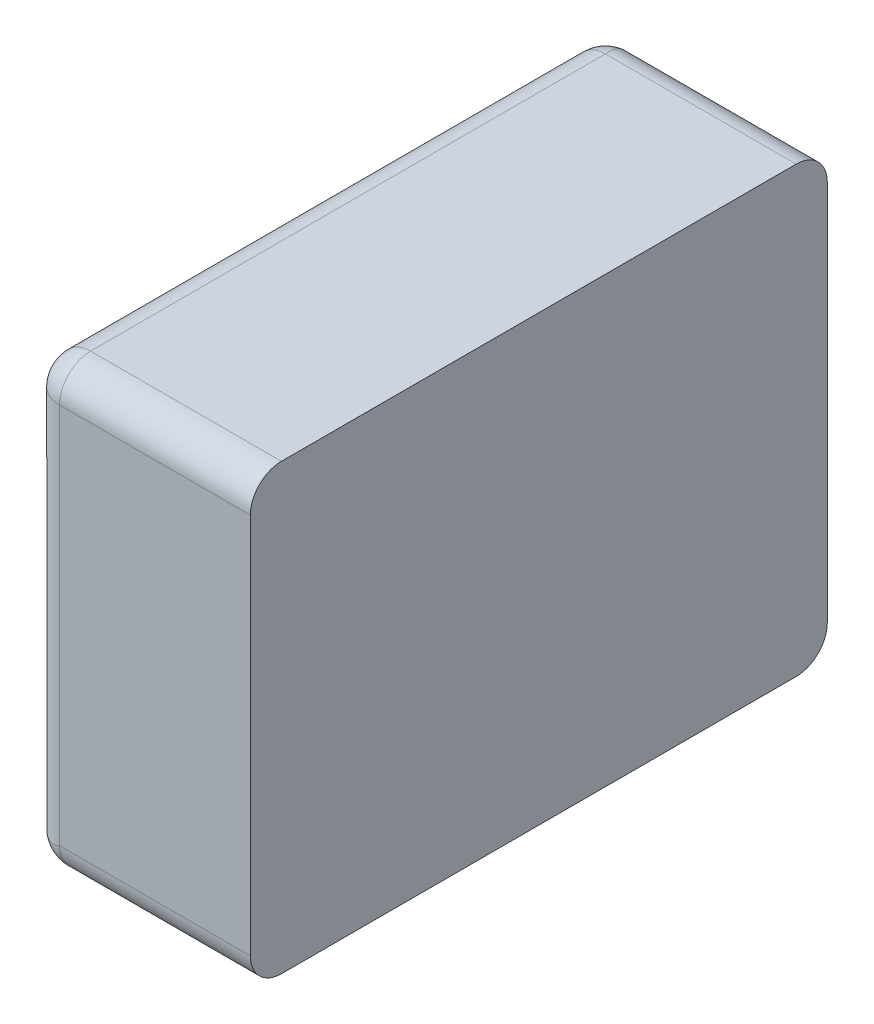
ISO-10303-21;
HEADER;
FILE_DESCRIPTION(('STEP AP214'),'2;1');
FILE_NAME('part.step','',(''),(''),'','','');
FILE_SCHEMA(('AUTOMOTIVE_DESIGN { 1 0 10303 214 1 1 1 1 }'));
ENDSEC;
DATA;
#1=APPLICATION_CONTEXT('core data for automotive mechanical design processes');
#2=APPLICATION_PROTOCOL_DEFINITION('international standard','automotive_design',2000,#1);
#3=PRODUCT_CONTEXT('',#1,'mechanical');
#4=PRODUCT('Part','Part','',(#3));
#5=PRODUCT_RELATED_PRODUCT_CATEGORY('part','',(#4));
#6=PRODUCT_DEFINITION_FORMATION('','',#4);
#7=PRODUCT_DEFINITION_CONTEXT('part definition',#1,'design');
#8=PRODUCT_DEFINITION('design','',#6,#7);
#9=PRODUCT_DEFINITION_SHAPE('','',#8);
#10=(LENGTH_UNIT() NAMED_UNIT(*) SI_UNIT(.MILLI.,.METRE.));
#11=(NAMED_UNIT(*) PLANE_ANGLE_UNIT() SI_UNIT($,.RADIAN.));
#12=(NAMED_UNIT(*) SI_UNIT($,.STERADIAN.) SOLID_ANGLE_UNIT());
#13=UNCERTAINTY_MEASURE_WITH_UNIT(LENGTH_MEASURE(1.E-05),#10,'distance_accuracy_value','');
#14=(GEOMETRIC_REPRESENTATION_CONTEXT(3) GLOBAL_UNCERTAINTY_ASSIGNED_CONTEXT((#13)) GLOBAL_UNIT_ASSIGNED_CONTEXT((#10,
#11,#12)) REPRESENTATION_CONTEXT('',''));
#15=CARTESIAN_POINT('',(0.,0.,0.));
#16=DIRECTION('',(0.,0.,1.));
#17=DIRECTION('',(1.,0.,0.));
#18=AXIS2_PLACEMENT_3D('',#15,#16,#17);
#19=CARTESIAN_POINT('',(-0.465,-0.215,0.035));
#20=DIRECTION('',(0.408248290463862,0.408248290463862,-0.816496580927727));
#21=DIRECTION('',(-0.577350269189627,-0.577350269189626,-0.577350269189624));
#22=AXIS2_PLACEMENT_3D('',#19,#20,#21);
#23=SPHERICAL_SURFACE('',#22,0.035);
#24=CARTESIAN_POINT('',(-0.465,-0.215,0.035));
#25=DIRECTION('',(0.,0.,-1.));
#26=DIRECTION('',(-1.,0.,0.));
#27=AXIS2_PLACEMENT_3D('',#24,#25,#26);
#28=CIRCLE('',#27,0.035);
#29=CARTESIAN_POINT('',(-0.465,-0.25,0.035));
#30=VERTEX_POINT('',#29);
#31=CARTESIAN_POINT('',(-0.5,-0.215,0.035));
#32=VERTEX_POINT('',#31);
#33=EDGE_CURVE('E11',#30,#32,#28,.T.);
#34=ORIENTED_EDGE('',*,*,#33,.T.);
#35=CARTESIAN_POINT('',(-0.465,-0.215,0.035));
#36=DIRECTION('',(0.,-1.,0.));
#37=DIRECTION('',(0.,0.,-1.));
#38=AXIS2_PLACEMENT_3D('',#35,#36,#37);
#39=CIRCLE('',#38,0.035);
#40=CARTESIAN_POINT('',(-0.465,-0.215,0.));
#41=VERTEX_POINT('',#40);
#42=EDGE_CURVE('E25',#32,#41,#39,.T.);
#43=ORIENTED_EDGE('',*,*,#42,.T.);
#44=CARTESIAN_POINT('',(-0.465,-0.215,0.));
#45=CARTESIAN_POINT('',(-0.465111612711924,-0.215243740660052,-1.03313121788324E-09));
#46=CARTESIAN_POINT('',(-0.465220629481718,-0.215488666732516,3.07994713752404E-06));
#47=CARTESIAN_POINT('',(-0.465433885748775,-0.215981520070315,1.54213448005007E-05));
#48=CARTESIAN_POINT('',(-0.465538105940278,-0.216229455116116,2.47047353632996E-05));
#49=CARTESIAN_POINT('',(-0.465741732728677,-0.216728068059787,4.95126755131809E-05));
#50=CARTESIAN_POINT('',(-0.465841119852847,-0.216978752749827,6.5060450524553E-05));
#51=CARTESIAN_POINT('',(-0.466035053958947,-0.217482605532488,0.000102452445534109));
#52=CARTESIAN_POINT('',(-0.466129581379983,-0.217735779413988,0.000124320072643491));
#53=CARTESIAN_POINT('',(-0.466313776392918,-0.218244348899178,0.00017440254172946));
#54=CARTESIAN_POINT('',(-0.466403424402808,-0.218499749275707,0.000202640909732528));
#55=CARTESIAN_POINT('',(-0.466577848292495,-0.219012507395305,0.000265510172820462));
#56=CARTESIAN_POINT('',(-0.466662604636929,-0.219269868886962,0.000300164647462443));
#57=CARTESIAN_POINT('',(-0.466827241108787,-0.219786286919367,0.000375907162554592));
#58=CARTESIAN_POINT('',(-0.466907101816688,-0.220045346199856,0.000417018776369786));
#59=CARTESIAN_POINT('',(-0.467061947217244,-0.220564882823023,0.000505707891539696));
#60=CARTESIAN_POINT('',(-0.467136912658727,-0.220825361855251,0.000553308885241232));
#61=CARTESIAN_POINT('',(-0.467354908381942,-0.221609968604591,0.000706139736048346));
#62=CARTESIAN_POINT('',(-0.467490140608452,-0.222134442299266,0.000820984013978112));
#63=CARTESIAN_POINT('',(-0.467741374273634,-0.223185841676211,0.0010767387258538));
#64=CARTESIAN_POINT('',(-0.467857228778892,-0.223712757469804,0.00121783256577717));
#65=CARTESIAN_POINT('',(-0.468070002263369,-0.224766949596737,0.00152617607159482));
#66=CARTESIAN_POINT('',(-0.468166781309575,-0.225294202048866,0.00169360392114075));
#67=CARTESIAN_POINT('',(-0.468341794125163,-0.226346926690304,0.00205460359238605));
#68=CARTESIAN_POINT('',(-0.468419896278803,-0.226872361926918,0.00224834669154829));
#69=CARTESIAN_POINT('',(-0.468558060079502,-0.227919345661508,0.00266187397459508));
#70=CARTESIAN_POINT('',(-0.468617999653095,-0.228440845843563,0.00288182110244223));
#71=CARTESIAN_POINT('',(-0.468720448187068,-0.229477876626666,0.00334755767046511));
#72=CARTESIAN_POINT('',(-0.468762845535282,-0.229993349320268,0.00359350045178805));
#73=CARTESIAN_POINT('',(-0.468830922361839,-0.231016280639682,0.00411093349099743));
#74=CARTESIAN_POINT('',(-0.468856501350634,-0.23152367372897,0.00438256641507604));
#75=CARTESIAN_POINT('',(-0.468891752157373,-0.232528447342334,0.00495098793051568));
#76=CARTESIAN_POINT('',(-0.468901334999283,-0.233025756761079,0.00524790763666658));
#77=CARTESIAN_POINT('',(-0.468905497314477,-0.234008419811665,0.00586641376765002));
#78=CARTESIAN_POINT('',(-0.468899999455456,-0.234493698895198,0.00618811908026279));
#79=CARTESIAN_POINT('',(-0.468874991771525,-0.235450421844009,0.00685561052472573));
#80=CARTESIAN_POINT('',(-0.468855416137075,-0.235921789865429,0.00720150284269199));
#81=CARTESIAN_POINT('',(-0.468803325972781,-0.236848883390665,0.00791668610202663));
#82=CARTESIAN_POINT('',(-0.468770756798167,-0.237304533887315,0.00828607025275676));
#83=CARTESIAN_POINT('',(-0.468693827906318,-0.238198465147439,0.00904745977856767));
#84=CARTESIAN_POINT('',(-0.468649424130771,-0.238636673823173,0.0094395453073941));
#85=CARTESIAN_POINT('',(-0.468550042880493,-0.239494081877566,0.0102454665261899));
#86=CARTESIAN_POINT('',(-0.46849503115435,-0.239913214090433,0.010659369426859));
#87=CARTESIAN_POINT('',(-0.468375712170395,-0.240730924439449,0.0115079626417149));
#88=CARTESIAN_POINT('',(-0.468311379508136,-0.24112944222653,0.0119427075214746));
#89=CARTESIAN_POINT('',(-0.468174750640235,-0.241904480393031,0.0128319326780499));
#90=CARTESIAN_POINT('',(-0.468102436759082,-0.242280949002712,0.0132864553513876));
#91=CARTESIAN_POINT('',(-0.467951223461324,-0.243010553093937,0.0142140976534304));
#92=CARTESIAN_POINT('',(-0.467872312845424,-0.243363646993975,0.0146872481556479));
#93=CARTESIAN_POINT('',(-0.467709322047743,-0.24404527918449,0.0156509245104299));
#94=CARTESIAN_POINT('',(-0.467625235779704,-0.244373787518085,0.0161414705203753));
#95=CARTESIAN_POINT('',(-0.46745333933637,-0.245005144400936,0.0171386367904849));
#96=CARTESIAN_POINT('',(-0.46736552673908,-0.245307975865549,0.017645267449571));
#97=CARTESIAN_POINT('',(-0.467187644541206,-0.245886997623915,0.0186732264837271));
#98=CARTESIAN_POINT('',(-0.46709757467388,-0.246163184750225,0.0191945565967516));
#99=CARTESIAN_POINT('',(-0.466916657514606,-0.246688063108948,0.0202504670074886));
#100=CARTESIAN_POINT('',(-0.466825810567597,-0.246936765921816,0.020785041607539));
#101=CARTESIAN_POINT('',(-0.466644822850269,-0.247405950840186,0.0218659272634811));
#102=CARTESIAN_POINT('',(-0.466554681484352,-0.247626459881027,0.0224122265262787));
#103=CARTESIAN_POINT('',(-0.466376583863148,-0.248038664969825,0.0235149867097744));
#104=CARTESIAN_POINT('',(-0.466288624536903,-0.248230403683926,0.0240714311827869));
#105=CARTESIAN_POINT('',(-0.466116356585997,-0.248584610279058,0.0251928514102044));
#106=CARTESIAN_POINT('',(-0.466032040923638,-0.248747136696717,0.0257578075882802));
#107=CARTESIAN_POINT('',(-0.465868503907326,-0.249042596740997,0.0268945709012228));
#108=CARTESIAN_POINT('',(-0.465789270127003,-0.249175604674644,0.0274663569255934));
#109=CARTESIAN_POINT('',(-0.465637310030175,-0.249411841774386,0.0286150561499456));
#110=CARTESIAN_POINT('',(-0.465564564571695,-0.249515160678849,0.0291919483482462));
#111=CARTESIAN_POINT('',(-0.465426955223335,-0.24969197165179,0.030349097243533));
#112=CARTESIAN_POINT('',(-0.46536206427015,-0.249765568305483,0.0309293347257463));
#113=CARTESIAN_POINT('',(-0.465241491601007,-0.249883016607641,0.0320913854999231));
#114=CARTESIAN_POINT('',(-0.465185773836936,-0.249926986895526,0.0326731830258738));
#115=CARTESIAN_POINT('',(-0.46508481781809,-0.249985419922284,0.0338365222126201));
#116=CARTESIAN_POINT('',(-0.465039533648617,-0.250000014219777,0.034418053300633));
#117=CARTESIAN_POINT('',(-0.465,-0.25,0.035));
#118=B_SPLINE_CURVE_WITH_KNOTS('',3,(#44,#45,#46,#47,#48,#49,#50,#51,#52,#53,#54,#55,#56,#57,
#58,#59,#60,#61,#62,#63,#64,#65,#66,#67,#68,#69,#70,#71,#72,#73,#74,#75,#76,#77,#78,#79,#80,#81,
#82,#83,#84,#85,#86,#87,#88,#89,#90,#91,#92,#93,#94,#95,#96,#97,#98,#99,#100,#101,#102,#103,
#104,#105,#106,#107,#108,#109,#110,#111,#112,#113,#114,#115,#116,#117),.UNSPECIFIED.,.F.,.F.,(4,
2,2,2,2,2,2,2,2,2,2,2,2,2,2,2,2,2,2,2,2,2,2,2,2,2,2,2,2,2,2,2,2,2,2,2,4),(0.,
0.000804202894423743,0.00161140112012554,0.00242162001218123,0.00323487907148141,
0.00405119199335701,0.00487056670714094,0.00569300542608973,0.00651850470709532,
0.0081784637161977,0.00985048891785636,0.0115343571056827,0.0132297631362427,0.0149363236396878,
0.0166535810697015,0.0183810080428296,0.0201180119227882,0.0218639396106708,0.0236180825069812,
0.0253796816160158,0.027147932767272,0.0289219919322403,0.0307009806181439,0.0324839913229419,
0.034270093038217,0.0360583367884569,0.0378477611967303,0.0396373980678723,0.041426277981054,
0.0432134358840201,0.0449979166813543,0.0467787808088675,0.0485551097856008,0.0503260117339757,
0.0520906268573044,0.0538481328621556,0.0555977503109577),.UNSPECIFIED.);
#119=EDGE_CURVE('E108',#41,#30,#118,.T.);
#120=ORIENTED_EDGE('',*,*,#119,.T.);
#121=EDGE_LOOP('',(#34,#43,#120));
#122=FACE_BOUND('',#121,.T.);
#123=ADVANCED_FACE('F17',(#122),#23,.T.);
#124=CARTESIAN_POINT('',(-0.465,0.215,0.035));
#125=DIRECTION('',(0.408248290463863,-0.408248290463862,-0.816496580927727));
#126=DIRECTION('',(-0.577350269189628,0.577350269189625,-0.577350269189625));
#127=AXIS2_PLACEMENT_3D('',#124,#125,#126);
#128=SPHERICAL_SURFACE('',#127,0.035);
#129=CARTESIAN_POINT('',(-0.465,0.215,0.035));
#130=DIRECTION('',(0.,0.,-1.));
#131=DIRECTION('',(0.,1.,0.));
#132=AXIS2_PLACEMENT_3D('',#129,#130,#131);
#133=CIRCLE('',#132,0.035);
#134=CARTESIAN_POINT('',(-0.5,0.215,0.035));
#135=VERTEX_POINT('',#134);
#136=CARTESIAN_POINT('',(-0.465,0.25,0.035));
#137=VERTEX_POINT('',#136);
#138=EDGE_CURVE('E295',#135,#137,#133,.T.);
#139=ORIENTED_EDGE('',*,*,#138,.T.);
#140=CARTESIAN_POINT('',(-0.465,0.25,0.035));
#141=CARTESIAN_POINT('',(-0.465039533648617,0.250000014219777,0.034418053300633));
#142=CARTESIAN_POINT('',(-0.46508481781809,0.249985419922284,0.0338365222126201));
#143=CARTESIAN_POINT('',(-0.465185773836936,0.249926986895526,0.0326731830258739));
#144=CARTESIAN_POINT('',(-0.465241491601008,0.249883016607641,0.0320913854999232));
#145=CARTESIAN_POINT('',(-0.465362064270151,0.249765568305483,0.0309293347257464));
#146=CARTESIAN_POINT('',(-0.465426955223335,0.24969197165179,0.0303490972435331));
#147=CARTESIAN_POINT('',(-0.465564564571695,0.249515160678849,0.0291919483482462));
#148=CARTESIAN_POINT('',(-0.465637310030175,0.249411841774386,0.0286150561499456));
#149=CARTESIAN_POINT('',(-0.465789270127004,0.249175604674644,0.0274663569255934));
#150=CARTESIAN_POINT('',(-0.465868503907326,0.249042596740997,0.0268945709012228));
#151=CARTESIAN_POINT('',(-0.466032040923638,0.248747136696717,0.0257578075882802));
#152=CARTESIAN_POINT('',(-0.466116356585997,0.248584610279058,0.0251928514102044));
#153=CARTESIAN_POINT('',(-0.466288624536903,0.248230403683926,0.0240714311827869));
#154=CARTESIAN_POINT('',(-0.466376583863148,0.248038664969825,0.0235149867097744));
#155=CARTESIAN_POINT('',(-0.466554681484352,0.247626459881026,0.0224122265262787));
#156=CARTESIAN_POINT('',(-0.466644822850269,0.247405950840186,0.0218659272634811));
#157=CARTESIAN_POINT('',(-0.466825810567597,0.246936765921816,0.020785041607539));
#158=CARTESIAN_POINT('',(-0.466916657514606,0.246688063108949,0.0202504670074887));
#159=CARTESIAN_POINT('',(-0.46709757467388,0.246163184750225,0.0191945565967516));
#160=CARTESIAN_POINT('',(-0.467187644541206,0.245886997623915,0.0186732264837271));
#161=CARTESIAN_POINT('',(-0.46736552673908,0.245307975865549,0.0176452674495711));
#162=CARTESIAN_POINT('',(-0.46745333933637,0.245005144400936,0.0171386367904849));
#163=CARTESIAN_POINT('',(-0.467625235779704,0.244373787518085,0.0161414705203753));
#164=CARTESIAN_POINT('',(-0.467709322047744,0.24404527918449,0.0156509245104299));
#165=CARTESIAN_POINT('',(-0.467872312845424,0.243363646993975,0.0146872481556479));
#166=CARTESIAN_POINT('',(-0.467951223461324,0.243010553093937,0.0142140976534304));
#167=CARTESIAN_POINT('',(-0.468102436759082,0.242280949002712,0.0132864553513876));
#168=CARTESIAN_POINT('',(-0.468174750640235,0.241904480393031,0.0128319326780499));
#169=CARTESIAN_POINT('',(-0.468311379508136,0.24112944222653,0.0119427075214746));
#170=CARTESIAN_POINT('',(-0.468375712170396,0.240730924439448,0.0115079626417148));
#171=CARTESIAN_POINT('',(-0.46849503115435,0.239913214090433,0.010659369426859));
#172=CARTESIAN_POINT('',(-0.468550042880493,0.239494081877566,0.0102454665261898));
#173=CARTESIAN_POINT('',(-0.468649424130772,0.238636673823173,0.00943954530739408));
#174=CARTESIAN_POINT('',(-0.468693827906318,0.238198465147439,0.00904745977856765));
#175=CARTESIAN_POINT('',(-0.468770756798168,0.237304533887315,0.00828607025275674));
#176=CARTESIAN_POINT('',(-0.468803325972781,0.236848883390665,0.00791668610202661));
#177=CARTESIAN_POINT('',(-0.468855416137075,0.235921789865429,0.00720150284269198));
#178=CARTESIAN_POINT('',(-0.468874991771525,0.235450421844009,0.00685561052472571));
#179=CARTESIAN_POINT('',(-0.468899999455456,0.234493698895198,0.00618811908026278));
#180=CARTESIAN_POINT('',(-0.468905497314477,0.234008419811665,0.00586641376765001));
#181=CARTESIAN_POINT('',(-0.468901334999283,0.233025756761079,0.00524790763666659));
#182=CARTESIAN_POINT('',(-0.468891752157373,0.232528447342334,0.0049509879305157));
#183=CARTESIAN_POINT('',(-0.468856501350634,0.23152367372897,0.00438256641507606));
#184=CARTESIAN_POINT('',(-0.468830922361839,0.231016280639683,0.00411093349099744));
#185=CARTESIAN_POINT('',(-0.468762845535282,0.229993349320268,0.00359350045178806));
#186=CARTESIAN_POINT('',(-0.468720448187068,0.229477876626666,0.00334755767046512));
#187=CARTESIAN_POINT('',(-0.468617999653095,0.228440845843563,0.00288182110244223));
#188=CARTESIAN_POINT('',(-0.468558060079502,0.227919345661508,0.00266187397459508));
#189=CARTESIAN_POINT('',(-0.468419896278803,0.226872361926918,0.00224834669154829));
#190=CARTESIAN_POINT('',(-0.468341794125163,0.226346926690304,0.00205460359238605));
#191=CARTESIAN_POINT('',(-0.468166781309575,0.225294202048866,0.00169360392114074));
#192=CARTESIAN_POINT('',(-0.468070002263369,0.224766949596737,0.0015261760715948));
#193=CARTESIAN_POINT('',(-0.467857228778892,0.223712757469804,0.00121783256577715));
#194=CARTESIAN_POINT('',(-0.467741374273634,0.223185841676211,0.0010767387258538));
#195=CARTESIAN_POINT('',(-0.467490140608452,0.222134442299266,0.000820984013978118));
#196=CARTESIAN_POINT('',(-0.467354908381942,0.221609968604591,0.000706139736048343));
#197=CARTESIAN_POINT('',(-0.467136912658727,0.220825361855251,0.000553308885241231));
#198=CARTESIAN_POINT('',(-0.467061947217244,0.220564882823023,0.000505707891539698));
#199=CARTESIAN_POINT('',(-0.466907101816688,0.220045346199856,0.000417018776369788));
#200=CARTESIAN_POINT('',(-0.466827241108787,0.219786286919367,0.000375907162554591));
#201=CARTESIAN_POINT('',(-0.466662604636929,0.219269868886962,0.000300164647462441));
#202=CARTESIAN_POINT('',(-0.466577848292495,0.219012507395305,0.000265510172820461));
#203=CARTESIAN_POINT('',(-0.466403424402808,0.218499749275707,0.000202640909732528));
#204=CARTESIAN_POINT('',(-0.466313776392918,0.218244348899178,0.000174402541729461));
#205=CARTESIAN_POINT('',(-0.466129581379983,0.217735779413988,0.000124320072643491));
#206=CARTESIAN_POINT('',(-0.466035053958947,0.217482605532488,0.000102452445534108));
#207=CARTESIAN_POINT('',(-0.465841119852847,0.216978752749827,6.50604505245525E-05));
#208=CARTESIAN_POINT('',(-0.465741732728677,0.216728068059787,4.9512675513182E-05));
#209=CARTESIAN_POINT('',(-0.465538105940278,0.216229455116116,2.47047353632983E-05));
#210=CARTESIAN_POINT('',(-0.465433885748775,0.215981520070315,1.54213448004956E-05));
#211=CARTESIAN_POINT('',(-0.465220629481718,0.215488666732516,3.07994713751589E-06));
#212=CARTESIAN_POINT('',(-0.465111612711924,0.215243740660052,-1.03313122539466E-09));
#213=CARTESIAN_POINT('',(-0.465,0.215,0.));
#214=B_SPLINE_CURVE_WITH_KNOTS('',3,(#140,#141,#142,#143,#144,#145,#146,#147,#148,#149,#150,
#151,#152,#153,#154,#155,#156,#157,#158,#159,#160,#161,#162,#163,#164,#165,#166,#167,#168,#169,
#170,#171,#172,#173,#174,#175,#176,#177,#178,#179,#180,#181,#182,#183,#184,#185,#186,#187,#188,
#189,#190,#191,#192,#193,#194,#195,#196,#197,#198,#199,#200,#201,#202,#203,#204,#205,#206,#207,
#208,#209,#210,#211,#212,#213),.UNSPECIFIED.,.F.,.F.,(4,2,2,2,2,2,2,2,2,2,2,2,2,2,2,2,2,2,2,2,2,
2,2,2,2,2,2,2,2,2,2,2,2,2,2,2,4),(0.,0.00174961744880199,0.00350712345365322,0.0052717385769819,
0.00704264052535691,0.00881896950209018,0.0105998336296034,0.0123843144269376,
0.0141714723299037,0.0159603522430853,0.0177499891142273,0.0195394135225007,0.0213276572727407,
0.0231137589880158,0.0248967696928138,0.0266757583787174,0.0284498175436857,0.0302180686949419,
0.0319796678039765,0.0337338107002869,0.0354797383881695,0.037216742268128,0.0389441692412561,
0.0406614266712698,0.042367987174715,0.044063393205275,0.0457472613931014,0.04741928659476,
0.0490792456038624,0.049904744884868,0.0507271836038167,0.0515465583176006,0.0523628712394762,
0.0531761302987764,0.0539863491908321,0.0547935474165339,0.0555977503109577),.UNSPECIFIED.);
#215=CARTESIAN_POINT('',(-0.465,0.215,0.));
#216=VERTEX_POINT('',#215);
#217=EDGE_CURVE('E264',#137,#216,#214,.T.);
#218=ORIENTED_EDGE('',*,*,#217,.T.);
#219=CARTESIAN_POINT('',(-0.465,0.215,0.035));
#220=DIRECTION('',(0.,1.,0.));
#221=DIRECTION('',(-1.,0.,0.));
#222=AXIS2_PLACEMENT_3D('',#219,#220,#221);
#223=CIRCLE('',#222,0.0350000000000001);
#224=EDGE_CURVE('E259',#216,#135,#223,.T.);
#225=ORIENTED_EDGE('',*,*,#224,.T.);
#226=EDGE_LOOP('',(#139,#218,#225));
#227=FACE_BOUND('',#226,.T.);
#228=ADVANCED_FACE('F278',(#227),#128,.T.);
#229=CARTESIAN_POINT('',(-0.3125,0.215,0.035));
#230=DIRECTION('',(-1.,0.,0.));
#231=DIRECTION('',(0.,0.707106781186548,-0.707106781186547));
#232=AXIS2_PLACEMENT_3D('',#229,#230,#231);
#233=CYLINDRICAL_SURFACE('',#232,0.035);
#234=CARTESIAN_POINT('',(-0.25,0.215,0.035));
#235=DIRECTION('',(-1.,0.,0.));
#236=DIRECTION('',(0.,0.707106781186548,-0.707106781186547));
#237=AXIS2_PLACEMENT_3D('',#234,#235,#236);
#238=CIRCLE('',#237,0.035);
#239=CARTESIAN_POINT('',(-0.25,0.25,0.035));
#240=VERTEX_POINT('',#239);
#241=CARTESIAN_POINT('',(-0.25,0.215,0.));
#242=VERTEX_POINT('',#241);
#243=EDGE_CURVE('E257',#240,#242,#238,.T.);
#244=ORIENTED_EDGE('',*,*,#243,.T.);
#245=DIRECTION('',(-1.,0.,0.));
#246=VECTOR('',#245,1.);
#247=CARTESIAN_POINT('',(-0.3125,0.215,0.));
#248=LINE('',#247,#246);
#249=EDGE_CURVE('E118',#242,#216,#248,.T.);
#250=ORIENTED_EDGE('',*,*,#249,.T.);
#251=ORIENTED_EDGE('',*,*,#217,.F.);
#252=DIRECTION('',(1.,0.,0.));
#253=VECTOR('',#252,1.);
#254=CARTESIAN_POINT('',(-0.3125,0.25,0.035));
#255=LINE('',#254,#253);
#256=EDGE_CURVE('E249',#137,#240,#255,.T.);
#257=ORIENTED_EDGE('',*,*,#256,.T.);
#258=EDGE_LOOP('',(#244,#250,#251,#257));
#259=FACE_BOUND('',#258,.T.);
#260=ADVANCED_FACE('F270',(#259),#233,.T.);
#261=CARTESIAN_POINT('',(-0.465,0.125,0.035));
#262=DIRECTION('',(0.,-1.,0.));
#263=DIRECTION('',(-0.707106781186549,0.,-0.707106781186546));
#264=AXIS2_PLACEMENT_3D('',#261,#262,#263);
#265=CYLINDRICAL_SURFACE('',#264,0.035);
#266=ORIENTED_EDGE('',*,*,#42,.F.);
#267=DIRECTION('',(0.,1.,0.));
#268=VECTOR('',#267,1.);
#269=CARTESIAN_POINT('',(-0.5,0.125,0.035));
#270=LINE('',#269,#268);
#271=EDGE_CURVE('E246',#32,#135,#270,.T.);
#272=ORIENTED_EDGE('',*,*,#271,.T.);
#273=ORIENTED_EDGE('',*,*,#224,.F.);
#274=DIRECTION('',(0.,-1.,0.));
#275=VECTOR('',#274,1.);
#276=CARTESIAN_POINT('',(-0.465,0.125,0.));
#277=LINE('',#276,#275);
#278=EDGE_CURVE('E244',#216,#41,#277,.T.);
#279=ORIENTED_EDGE('',*,*,#278,.T.);
#280=EDGE_LOOP('',(#266,#272,#273,#279));
#281=FACE_BOUND('',#280,.T.);
#282=ADVANCED_FACE('F229',(#281),#265,.T.);
#283=CARTESIAN_POINT('',(-0.465,-0.215,0.615));
#284=DIRECTION('',(-0.408248290463864,-0.408248290463863,-0.816496580927726));
#285=DIRECTION('',(-0.577350269189626,-0.577350269189625,0.577350269189626));
#286=AXIS2_PLACEMENT_3D('',#283,#284,#285);
#287=SPHERICAL_SURFACE('',#286,0.035);
#288=CARTESIAN_POINT('',(-0.465,-0.215,0.65));
#289=CARTESIAN_POINT('',(-0.465243740660052,-0.215111612711924,0.650000001033131));
#290=CARTESIAN_POINT('',(-0.465488666732516,-0.215220629481718,0.649996920052863));
#291=CARTESIAN_POINT('',(-0.465981520070315,-0.215433885748775,0.6499845786552));
#292=CARTESIAN_POINT('',(-0.466229455116116,-0.215538105940278,0.649975295264637));
#293=CARTESIAN_POINT('',(-0.466728068059787,-0.215741732728677,0.649950487324487));
#294=CARTESIAN_POINT('',(-0.466978752749827,-0.215841119852846,0.649934939549475));
#295=CARTESIAN_POINT('',(-0.467482605532488,-0.216035053958947,0.649897547554466));
#296=CARTESIAN_POINT('',(-0.467735779413988,-0.216129581379983,0.649875679927357));
#297=CARTESIAN_POINT('',(-0.468244348899179,-0.216313776392918,0.649825597458271));
#298=CARTESIAN_POINT('',(-0.468499749275707,-0.216403424402807,0.649797359090267));
#299=CARTESIAN_POINT('',(-0.469012507395305,-0.216577848292495,0.64973448982718));
#300=CARTESIAN_POINT('',(-0.469269868886963,-0.216662604636929,0.649699835352538));
#301=CARTESIAN_POINT('',(-0.469786286919367,-0.216827241108786,0.649624092837445));
#302=CARTESIAN_POINT('',(-0.470045346199856,-0.216907101816688,0.64958298122363));
#303=CARTESIAN_POINT('',(-0.470564882823023,-0.217061947217244,0.64949429210846));
#304=CARTESIAN_POINT('',(-0.470825361855251,-0.217136912658726,0.649446691114759));
#305=CARTESIAN_POINT('',(-0.471609968604591,-0.217354908381942,0.649293860263952));
#306=CARTESIAN_POINT('',(-0.472134442299266,-0.217490140608452,0.649179015986022));
#307=CARTESIAN_POINT('',(-0.473185841676211,-0.217741374273633,0.648923261274146));
#308=CARTESIAN_POINT('',(-0.473712757469804,-0.217857228778892,0.648782167434223));
#309=CARTESIAN_POINT('',(-0.474766949596737,-0.218070002263369,0.648473823928405));
#310=CARTESIAN_POINT('',(-0.475294202048866,-0.218166781309575,0.648306396078859));
#311=CARTESIAN_POINT('',(-0.476346926690304,-0.218341794125163,0.647945396407614));
#312=CARTESIAN_POINT('',(-0.476872361926918,-0.218419896278802,0.647751653308452));
#313=CARTESIAN_POINT('',(-0.477919345661508,-0.218558060079502,0.647338126025405));
#314=CARTESIAN_POINT('',(-0.478440845843563,-0.218617999653094,0.647118178897558));
#315=CARTESIAN_POINT('',(-0.479477876626667,-0.218720448187068,0.646652442329535));
#316=CARTESIAN_POINT('',(-0.479993349320268,-0.218762845535282,0.646406499548212));
#317=CARTESIAN_POINT('',(-0.481016280639683,-0.218830922361839,0.645889066509003));
#318=CARTESIAN_POINT('',(-0.48152367372897,-0.218856501350634,0.645617433584924));
#319=CARTESIAN_POINT('',(-0.482528447342334,-0.218891752157372,0.645049012069484));
#320=CARTESIAN_POINT('',(-0.483025756761079,-0.218901334999283,0.644752092363333));
#321=CARTESIAN_POINT('',(-0.484008419811665,-0.218905497314477,0.64413358623235));
#322=CARTESIAN_POINT('',(-0.484493698895198,-0.218899999455456,0.643811880919737));
#323=CARTESIAN_POINT('',(-0.485450421844009,-0.218874991771525,0.643144389475274));
#324=CARTESIAN_POINT('',(-0.485921789865429,-0.218855416137075,0.642798497157308));
#325=CARTESIAN_POINT('',(-0.486848883390665,-0.218803325972781,0.642083313897973));
#326=CARTESIAN_POINT('',(-0.487304533887315,-0.218770756798167,0.641713929747243));
#327=CARTESIAN_POINT('',(-0.488198465147439,-0.218693827906318,0.640952540221432));
#328=CARTESIAN_POINT('',(-0.488636673823173,-0.218649424130771,0.640560454692606));
#329=CARTESIAN_POINT('',(-0.489494081877566,-0.218550042880492,0.63975453347381));
#330=CARTESIAN_POINT('',(-0.489913214090433,-0.21849503115435,0.639340630573141));
#331=CARTESIAN_POINT('',(-0.490730924439449,-0.218375712170395,0.638492037358285));
#332=CARTESIAN_POINT('',(-0.49112944222653,-0.218311379508135,0.638057292478525));
#333=CARTESIAN_POINT('',(-0.491904480393031,-0.218174750640234,0.63716806732195));
#334=CARTESIAN_POINT('',(-0.492280949002712,-0.218102436759082,0.636713544648613));
#335=CARTESIAN_POINT('',(-0.493010553093937,-0.217951223461324,0.63578590234657));
#336=CARTESIAN_POINT('',(-0.493363646993976,-0.217872312845424,0.635312751844352));
#337=CARTESIAN_POINT('',(-0.49404527918449,-0.217709322047743,0.63434907548957));
#338=CARTESIAN_POINT('',(-0.494373787518085,-0.217625235779704,0.633858529479625));
#339=CARTESIAN_POINT('',(-0.495005144400936,-0.21745333933637,0.632861363209515));
#340=CARTESIAN_POINT('',(-0.495307975865549,-0.21736552673908,0.632354732550429));
#341=CARTESIAN_POINT('',(-0.495886997623915,-0.217187644541206,0.631326773516273));
#342=CARTESIAN_POINT('',(-0.496163184750225,-0.217097574673879,0.630805443403248));
#343=CARTESIAN_POINT('',(-0.496688063108949,-0.216916657514606,0.629749532992511));
#344=CARTESIAN_POINT('',(-0.496936765921816,-0.216825810567597,0.629214958392461));
#345=CARTESIAN_POINT('',(-0.497405950840186,-0.216644822850269,0.628134072736519));
#346=CARTESIAN_POINT('',(-0.497626459881027,-0.216554681484352,0.627587773473721));
#347=CARTESIAN_POINT('',(-0.498038664969825,-0.216376583863148,0.626485013290226));
#348=CARTESIAN_POINT('',(-0.498230403683926,-0.216288624536903,0.625928568817213));
#349=CARTESIAN_POINT('',(-0.498584610279058,-0.216116356585997,0.624807148589796));
#350=CARTESIAN_POINT('',(-0.498747136696717,-0.216032040923638,0.62424219241172));
#351=CARTESIAN_POINT('',(-0.499042596740997,-0.215868503907326,0.623105429098777));
#352=CARTESIAN_POINT('',(-0.499175604674644,-0.215789270127003,0.622533643074407));
#353=CARTESIAN_POINT('',(-0.499411841774386,-0.215637310030175,0.621384943850054));
#354=CARTESIAN_POINT('',(-0.499515160678849,-0.215564564571694,0.620808051651754));
#355=CARTESIAN_POINT('',(-0.49969197165179,-0.215426955223335,0.619650902756467));
#356=CARTESIAN_POINT('',(-0.499765568305483,-0.21536206427015,0.619070665274254));
#357=CARTESIAN_POINT('',(-0.499883016607641,-0.215241491601007,0.617908614500077));
#358=CARTESIAN_POINT('',(-0.499926986895526,-0.215185773836936,0.617326816974126));
#359=CARTESIAN_POINT('',(-0.499985419922284,-0.21508481781809,0.61616347778738));
#360=CARTESIAN_POINT('',(-0.500000014219777,-0.215039533648617,0.615581946699367));
#361=CARTESIAN_POINT('',(-0.5,-0.215,0.615));
#362=B_SPLINE_CURVE_WITH_KNOTS('',3,(#288,#289,#290,#291,#292,#293,#294,#295,#296,#297,#298,
#299,#300,#301,#302,#303,#304,#305,#306,#307,#308,#309,#310,#311,#312,#313,#314,#315,#316,#317,
#318,#319,#320,#321,#322,#323,#324,#325,#326,#327,#328,#329,#330,#331,#332,#333,#334,#335,#336,
#337,#338,#339,#340,#341,#342,#343,#344,#345,#346,#347,#348,#349,#350,#351,#352,#353,#354,#355,
#356,#357,#358,#359,#360,#361),.UNSPECIFIED.,.F.,.F.,(4,2,2,2,2,2,2,2,2,2,2,2,2,2,2,2,2,2,2,2,2,
2,2,2,2,2,2,2,2,2,2,2,2,2,2,2,4),(0.,0.000804202894423778,0.00161140112012558,
0.00242162001218126,0.00323487907148141,0.00405119199335703,0.00487056670714096,
0.00569300542608976,0.00651850470709538,0.00817846371619774,0.0098504889178564,
0.0115343571056827,0.0132297631362428,0.0149363236396879,0.0166535810697016,0.0183810080428297,
0.0201180119227883,0.0218639396106709,0.0236180825069813,0.0253796816160159,0.0271479327672721,
0.0289219919322404,0.0307009806181439,0.032483991322942,0.034270093038217,0.036058336788457,
0.0378477611967305,0.0396373980678724,0.0414262779810542,0.0432134358840202,0.0449979166813544,
0.0467787808088676,0.0485551097856008,0.0503260117339759,0.0520906268573046,0.0538481328621558,
0.0555977503109577),.UNSPECIFIED.);
#363=CARTESIAN_POINT('',(-0.465,-0.215,0.65));
#364=VERTEX_POINT('',#363);
#365=CARTESIAN_POINT('',(-0.5,-0.215,0.615));
#366=VERTEX_POINT('',#365);
#367=EDGE_CURVE('E191',#364,#366,#362,.T.);
#368=ORIENTED_EDGE('',*,*,#367,.T.);
#369=CARTESIAN_POINT('',(-0.465,-0.215,0.615));
#370=DIRECTION('',(0.,0.,1.));
#371=DIRECTION('',(0.,-1.,0.));
#372=AXIS2_PLACEMENT_3D('',#369,#370,#371);
#373=CIRCLE('',#372,0.035);
#374=CARTESIAN_POINT('',(-0.465,-0.25,0.615));
#375=VERTEX_POINT('',#374);
#376=EDGE_CURVE('E187',#366,#375,#373,.T.);
#377=ORIENTED_EDGE('',*,*,#376,.T.);
#378=CARTESIAN_POINT('',(-0.465,-0.215,0.615));
#379=DIRECTION('',(-1.,0.,0.));
#380=DIRECTION('',(0.,0.,1.));
#381=AXIS2_PLACEMENT_3D('',#378,#379,#380);
#382=CIRCLE('',#381,0.035);
#383=EDGE_CURVE('E182',#375,#364,#382,.T.);
#384=ORIENTED_EDGE('',*,*,#383,.T.);
#385=EDGE_LOOP('',(#368,#377,#384));
#386=FACE_BOUND('',#385,.T.);
#387=ADVANCED_FACE('F225',(#386),#287,.T.);
#388=CARTESIAN_POINT('',(-0.465,-0.215,0.));
#389=DIRECTION('',(0.,0.,1.));
#390=DIRECTION('',(-0.707106781186548,-0.707106781186548,0.));
#391=AXIS2_PLACEMENT_3D('',#388,#389,#390);
#392=CYLINDRICAL_SURFACE('',#391,0.035);
#393=ORIENTED_EDGE('',*,*,#376,.F.);
#394=DIRECTION('',(0.,0.,-1.));
#395=VECTOR('',#394,1.);
#396=CARTESIAN_POINT('',(-0.5,-0.215,0.));
#397=LINE('',#396,#395);
#398=EDGE_CURVE('E178',#366,#32,#397,.T.);
#399=ORIENTED_EDGE('',*,*,#398,.T.);
#400=ORIENTED_EDGE('',*,*,#33,.F.);
#401=DIRECTION('',(0.,0.,1.));
#402=VECTOR('',#401,1.);
#403=CARTESIAN_POINT('',(-0.465,-0.25,0.));
#404=LINE('',#403,#402);
#405=EDGE_CURVE('E174',#30,#375,#404,.T.);
#406=ORIENTED_EDGE('',*,*,#405,.T.);
#407=EDGE_LOOP('',(#393,#399,#400,#406));
#408=FACE_BOUND('',#407,.T.);
#409=ADVANCED_FACE('F221',(#408),#392,.T.);
#410=CARTESIAN_POINT('',(-0.4375,-0.215,0.615));
#411=DIRECTION('',(1.,0.,0.));
#412=DIRECTION('',(0.,-0.707106781186548,0.707106781186548));
#413=AXIS2_PLACEMENT_3D('',#410,#411,#412);
#414=CYLINDRICAL_SURFACE('',#413,0.035);
#415=CARTESIAN_POINT('',(-0.25,-0.215,0.615));
#416=DIRECTION('',(-1.,0.,0.));
#417=DIRECTION('',(0.,-0.707106781186548,0.707106781186548));
#418=AXIS2_PLACEMENT_3D('',#415,#416,#417);
#419=CIRCLE('',#418,0.035);
#420=CARTESIAN_POINT('',(-0.25,-0.25,0.615));
#421=VERTEX_POINT('',#420);
#422=CARTESIAN_POINT('',(-0.25,-0.215,0.65));
#423=VERTEX_POINT('',#422);
#424=EDGE_CURVE('E172',#421,#423,#419,.T.);
#425=ORIENTED_EDGE('',*,*,#424,.T.);
#426=DIRECTION('',(-1.,0.,0.));
#427=VECTOR('',#426,1.);
#428=CARTESIAN_POINT('',(-0.4375,-0.215,0.65));
#429=LINE('',#428,#427);
#430=EDGE_CURVE('E167',#423,#364,#429,.T.);
#431=ORIENTED_EDGE('',*,*,#430,.T.);
#432=ORIENTED_EDGE('',*,*,#383,.F.);
#433=DIRECTION('',(1.,0.,0.));
#434=VECTOR('',#433,1.);
#435=CARTESIAN_POINT('',(-0.4375,-0.25,0.615));
#436=LINE('',#435,#434);
#437=EDGE_CURVE('E164',#375,#421,#436,.T.);
#438=ORIENTED_EDGE('',*,*,#437,.T.);
#439=EDGE_LOOP('',(#425,#431,#432,#438));
#440=FACE_BOUND('',#439,.T.);
#441=ADVANCED_FACE('F217',(#440),#414,.T.);
#442=CARTESIAN_POINT('',(-0.465,0.215,0.615));
#443=DIRECTION('',(-0.408248290463862,-0.816496580927727,0.408248290463863));
#444=DIRECTION('',(-0.577350269189626,0.577350269189625,0.577350269189626));
#445=AXIS2_PLACEMENT_3D('',#442,#443,#444);
#446=SPHERICAL_SURFACE('',#445,0.035);
#447=CARTESIAN_POINT('',(-0.465,0.215,0.615));
#448=DIRECTION('',(-1.,0.,0.));
#449=DIRECTION('',(0.,1.,0.));
#450=AXIS2_PLACEMENT_3D('',#447,#448,#449);
#451=CIRCLE('',#450,0.035);
#452=CARTESIAN_POINT('',(-0.465,0.215,0.65));
#453=VERTEX_POINT('',#452);
#454=CARTESIAN_POINT('',(-0.465,0.25,0.615));
#455=VERTEX_POINT('',#454);
#456=EDGE_CURVE('E162',#453,#455,#451,.T.);
#457=ORIENTED_EDGE('',*,*,#456,.T.);
#458=CARTESIAN_POINT('',(-0.465,0.215,0.615));
#459=DIRECTION('',(0.,0.,1.));
#460=DIRECTION('',(-1.,0.,0.));
#461=AXIS2_PLACEMENT_3D('',#458,#459,#460);
#462=CIRCLE('',#461,0.035);
#463=CARTESIAN_POINT('',(-0.5,0.215,0.615));
#464=VERTEX_POINT('',#463);
#465=EDGE_CURVE('E160',#455,#464,#462,.T.);
#466=ORIENTED_EDGE('',*,*,#465,.T.);
#467=CARTESIAN_POINT('',(-0.465,0.215,0.615));
#468=DIRECTION('',(0.,1.,0.));
#469=DIRECTION('',(0.,0.,1.));
#470=AXIS2_PLACEMENT_3D('',#467,#468,#469);
#471=CIRCLE('',#470,0.035);
#472=EDGE_CURVE('E157',#464,#453,#471,.T.);
#473=ORIENTED_EDGE('',*,*,#472,.T.);
#474=EDGE_LOOP('',(#457,#466,#473));
#475=FACE_BOUND('',#474,.T.);
#476=ADVANCED_FACE('F213',(#475),#446,.T.);
#477=CARTESIAN_POINT('',(-0.465,0.215,0.));
#478=DIRECTION('',(0.,0.,1.));
#479=DIRECTION('',(-0.707106781186548,0.707106781186547,0.));
#480=AXIS2_PLACEMENT_3D('',#477,#478,#479);
#481=CYLINDRICAL_SURFACE('',#480,0.035);
#482=ORIENTED_EDGE('',*,*,#465,.F.);
#483=DIRECTION('',(0.,0.,-1.));
#484=VECTOR('',#483,1.);
#485=CARTESIAN_POINT('',(-0.465,0.25,0.));
#486=LINE('',#485,#484);
#487=EDGE_CURVE('E152',#455,#137,#486,.T.);
#488=ORIENTED_EDGE('',*,*,#487,.T.);
#489=ORIENTED_EDGE('',*,*,#138,.F.);
#490=DIRECTION('',(0.,0.,1.));
#491=VECTOR('',#490,1.);
#492=CARTESIAN_POINT('',(-0.5,0.215,0.));
#493=LINE('',#492,#491);
#494=EDGE_CURVE('E149',#135,#464,#493,.T.);
#495=ORIENTED_EDGE('',*,*,#494,.T.);
#496=EDGE_LOOP('',(#482,#488,#489,#495));
#497=FACE_BOUND('',#496,.T.);
#498=ADVANCED_FACE('F208',(#497),#481,.T.);
#499=CARTESIAN_POINT('',(-0.465,0.125,0.615));
#500=DIRECTION('',(0.,-1.,0.));
#501=DIRECTION('',(-0.707106781186548,0.,0.707106781186548));
#502=AXIS2_PLACEMENT_3D('',#499,#500,#501);
#503=CYLINDRICAL_SURFACE('',#502,0.035);
#504=ORIENTED_EDGE('',*,*,#367,.F.);
#505=DIRECTION('',(0.,1.,0.));
#506=VECTOR('',#505,1.);
#507=CARTESIAN_POINT('',(-0.465,0.125,0.65));
#508=LINE('',#507,#506);
#509=EDGE_CURVE('E144',#364,#453,#508,.T.);
#510=ORIENTED_EDGE('',*,*,#509,.T.);
#511=ORIENTED_EDGE('',*,*,#472,.F.);
#512=DIRECTION('',(0.,-1.,0.));
#513=VECTOR('',#512,1.);
#514=CARTESIAN_POINT('',(-0.5,0.125,0.615));
#515=LINE('',#514,#513);
#516=EDGE_CURVE('E139',#464,#366,#515,.T.);
#517=ORIENTED_EDGE('',*,*,#516,.T.);
#518=EDGE_LOOP('',(#504,#510,#511,#517));
#519=FACE_BOUND('',#518,.T.);
#520=ADVANCED_FACE('F197',(#519),#503,.T.);
#521=CARTESIAN_POINT('',(-0.3125,0.215,0.615));
#522=DIRECTION('',(-1.,0.,0.));
#523=DIRECTION('',(0.,0.707106781186548,0.707106781186548));
#524=AXIS2_PLACEMENT_3D('',#521,#522,#523);
#525=CYLINDRICAL_SURFACE('',#524,0.035);
#526=CARTESIAN_POINT('',(-0.25,0.215,0.615));
#527=DIRECTION('',(-1.,0.,0.));
#528=DIRECTION('',(0.,0.707106781186548,0.707106781186548));
#529=AXIS2_PLACEMENT_3D('',#526,#527,#528);
#530=CIRCLE('',#529,0.035);
#531=CARTESIAN_POINT('',(-0.25,0.215,0.65));
#532=VERTEX_POINT('',#531);
#533=CARTESIAN_POINT('',(-0.25,0.25,0.615));
#534=VERTEX_POINT('',#533);
#535=EDGE_CURVE('E137',#532,#534,#530,.T.);
#536=ORIENTED_EDGE('',*,*,#535,.T.);
#537=DIRECTION('',(-1.,0.,0.));
#538=VECTOR('',#537,1.);
#539=CARTESIAN_POINT('',(-0.3125,0.25,0.615));
#540=LINE('',#539,#538);
#541=EDGE_CURVE('E134',#534,#455,#540,.T.);
#542=ORIENTED_EDGE('',*,*,#541,.T.);
#543=ORIENTED_EDGE('',*,*,#456,.F.);
#544=DIRECTION('',(1.,0.,0.));
#545=VECTOR('',#544,1.);
#546=CARTESIAN_POINT('',(-0.3125,0.215,0.65));
#547=LINE('',#546,#545);
#548=EDGE_CURVE('E101',#453,#532,#547,.T.);
#549=ORIENTED_EDGE('',*,*,#548,.T.);
#550=EDGE_LOOP('',(#536,#542,#543,#549));
#551=FACE_BOUND('',#550,.T.);
#552=ADVANCED_FACE('F207',(#551),#525,.T.);
#553=CARTESIAN_POINT('',(-0.4375,-0.215,0.035));
#554=DIRECTION('',(1.,0.,0.));
#555=DIRECTION('',(0.,-0.707106781186548,-0.707106781186547));
#556=AXIS2_PLACEMENT_3D('',#553,#554,#555);
#557=CYLINDRICAL_SURFACE('',#556,0.035);
#558=CARTESIAN_POINT('',(-0.25,-0.215,0.035));
#559=DIRECTION('',(-1.,0.,0.));
#560=DIRECTION('',(0.,-0.707106781186548,-0.707106781186547));
#561=AXIS2_PLACEMENT_3D('',#558,#559,#560);
#562=CIRCLE('',#561,0.035);
#563=CARTESIAN_POINT('',(-0.25,-0.215,0.));
#564=VERTEX_POINT('',#563);
#565=CARTESIAN_POINT('',(-0.25,-0.25,0.035));
#566=VERTEX_POINT('',#565);
#567=EDGE_CURVE('E91',#564,#566,#562,.T.);
#568=ORIENTED_EDGE('',*,*,#567,.T.);
#569=DIRECTION('',(-1.,0.,0.));
#570=VECTOR('',#569,1.);
#571=CARTESIAN_POINT('',(-0.4375,-0.25,0.035));
#572=LINE('',#571,#570);
#573=EDGE_CURVE('E102',#566,#30,#572,.T.);
#574=ORIENTED_EDGE('',*,*,#573,.T.);
#575=ORIENTED_EDGE('',*,*,#119,.F.);
#576=DIRECTION('',(1.,0.,0.));
#577=VECTOR('',#576,1.);
#578=CARTESIAN_POINT('',(-0.4375,-0.215,0.));
#579=LINE('',#578,#577);
#580=EDGE_CURVE('E106',#41,#564,#579,.T.);
#581=ORIENTED_EDGE('',*,*,#580,.T.);
#582=EDGE_LOOP('',(#568,#574,#575,#581));
#583=FACE_BOUND('',#582,.T.);
#584=ADVANCED_FACE('F107',(#583),#557,.T.);
#585=CARTESIAN_POINT('',(-0.375,0.,0.65));
#586=DIRECTION('',(0.,0.,1.));
#587=DIRECTION('',(1.,0.,0.));
#588=AXIS2_PLACEMENT_3D('',#585,#586,#587);
#589=PLANE('',#588);
#590=ORIENTED_EDGE('',*,*,#548,.F.);
#591=ORIENTED_EDGE('',*,*,#509,.F.);
#592=ORIENTED_EDGE('',*,*,#430,.F.);
#593=DIRECTION('',(0.,1.,0.));
#594=VECTOR('',#593,1.);
#595=CARTESIAN_POINT('',(-0.25,-0.25,0.65));
#596=LINE('',#595,#594);
#597=EDGE_CURVE('E113',#423,#532,#596,.T.);
#598=ORIENTED_EDGE('',*,*,#597,.T.);
#599=EDGE_LOOP('',(#590,#591,#592,#598));
#600=FACE_BOUND('',#599,.T.);
#601=ADVANCED_FACE('F308',(#600),#589,.T.);
#602=CARTESIAN_POINT('',(-0.5,-0.25,0.));
#603=DIRECTION('',(0.,-1.,0.));
#604=DIRECTION('',(1.,0.,0.));
#605=AXIS2_PLACEMENT_3D('',#602,#603,#604);
#606=PLANE('',#605);
#607=ORIENTED_EDGE('',*,*,#437,.F.);
#608=ORIENTED_EDGE('',*,*,#405,.F.);
#609=ORIENTED_EDGE('',*,*,#573,.F.);
#610=DIRECTION('',(0.,0.,1.));
#611=VECTOR('',#610,1.);
#612=CARTESIAN_POINT('',(-0.25,-0.25,0.));
#613=LINE('',#612,#611);
#614=EDGE_CURVE('E97',#566,#421,#613,.T.);
#615=ORIENTED_EDGE('',*,*,#614,.T.);
#616=EDGE_LOOP('',(#607,#608,#609,#615));
#617=FACE_BOUND('',#616,.T.);
#618=ADVANCED_FACE('F311',(#617),#606,.T.);
#619=CARTESIAN_POINT('',(-0.5,0.25,0.));
#620=DIRECTION('',(-1.,0.,0.));
#621=DIRECTION('',(0.,-1.,0.));
#622=AXIS2_PLACEMENT_3D('',#619,#620,#621);
#623=PLANE('',#622);
#624=ORIENTED_EDGE('',*,*,#271,.F.);
#625=ORIENTED_EDGE('',*,*,#398,.F.);
#626=ORIENTED_EDGE('',*,*,#516,.F.);
#627=ORIENTED_EDGE('',*,*,#494,.F.);
#628=EDGE_LOOP('',(#624,#625,#626,#627));
#629=FACE_BOUND('',#628,.T.);
#630=ADVANCED_FACE('F315',(#629),#623,.T.);
#631=CARTESIAN_POINT('',(-0.25,-0.25,0.));
#632=DIRECTION('',(1.,0.,0.));
#633=DIRECTION('',(0.,1.,0.));
#634=AXIS2_PLACEMENT_3D('',#631,#632,#633);
#635=PLANE('',#634);
#636=ORIENTED_EDGE('',*,*,#535,.F.);
#637=ORIENTED_EDGE('',*,*,#597,.F.);
#638=ORIENTED_EDGE('',*,*,#424,.F.);
#639=ORIENTED_EDGE('',*,*,#614,.F.);
#640=ORIENTED_EDGE('',*,*,#567,.F.);
#641=DIRECTION('',(0.,1.,0.));
#642=VECTOR('',#641,1.);
#643=CARTESIAN_POINT('',(-0.25,-0.25,0.));
#644=LINE('',#643,#642);
#645=EDGE_CURVE('E95',#564,#242,#644,.T.);
#646=ORIENTED_EDGE('',*,*,#645,.T.);
#647=ORIENTED_EDGE('',*,*,#243,.F.);
#648=DIRECTION('',(0.,0.,1.));
#649=VECTOR('',#648,1.);
#650=CARTESIAN_POINT('',(-0.25,0.25,0.));
#651=LINE('',#650,#649);
#652=EDGE_CURVE('E119',#240,#534,#651,.T.);
#653=ORIENTED_EDGE('',*,*,#652,.T.);
#654=EDGE_LOOP('',(#636,#637,#638,#639,#640,#646,#647,#653));
#655=FACE_BOUND('',#654,.T.);
#656=ADVANCED_FACE('F93',(#655),#635,.T.);
#657=CARTESIAN_POINT('',(-0.25,0.25,0.));
#658=DIRECTION('',(0.,1.,0.));
#659=DIRECTION('',(-1.,0.,0.));
#660=AXIS2_PLACEMENT_3D('',#657,#658,#659);
#661=PLANE('',#660);
#662=ORIENTED_EDGE('',*,*,#541,.F.);
#663=ORIENTED_EDGE('',*,*,#652,.F.);
#664=ORIENTED_EDGE('',*,*,#256,.F.);
#665=ORIENTED_EDGE('',*,*,#487,.F.);
#666=EDGE_LOOP('',(#662,#663,#664,#665));
#667=FACE_BOUND('',#666,.T.);
#668=ADVANCED_FACE('F322',(#667),#661,.T.);
#669=CARTESIAN_POINT('',(-0.375,0.,0.));
#670=DIRECTION('',(0.,0.,1.));
#671=DIRECTION('',(1.,0.,0.));
#672=AXIS2_PLACEMENT_3D('',#669,#670,#671);
#673=PLANE('',#672);
#674=ORIENTED_EDGE('',*,*,#249,.F.);
#675=ORIENTED_EDGE('',*,*,#645,.F.);
#676=ORIENTED_EDGE('',*,*,#580,.F.);
#677=ORIENTED_EDGE('',*,*,#278,.F.);
#678=EDGE_LOOP('',(#674,#675,#676,#677));
#679=FACE_BOUND('',#678,.T.);
#680=ADVANCED_FACE('F116',(#679),#673,.F.);
#681=CLOSED_SHELL('',(#123,#228,#260,#282,#387,#409,#441,#476,#498,#520,#552,#584,#601,#618,
#630,#656,#668,#680));
#682=MANIFOLD_SOLID_BREP('B1',#681);
#683=ADVANCED_BREP_SHAPE_REPRESENTATION('',(#18,#682),#14);
#684=SHAPE_DEFINITION_REPRESENTATION(#9,#683);
ENDSEC;
END-ISO-10303-21;
